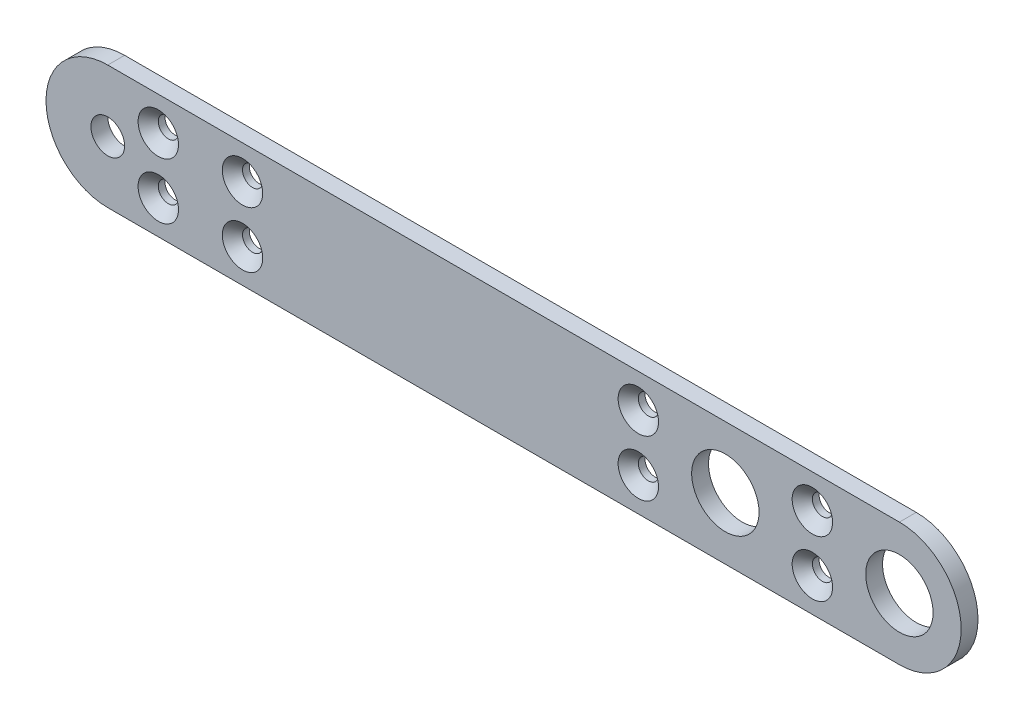
ISO-10303-21;
HEADER;
FILE_DESCRIPTION(('STEP AP214'),'2;1');
FILE_NAME('part.step','',(''),(''),'','','');
FILE_SCHEMA(('AUTOMOTIVE_DESIGN { 1 0 10303 214 1 1 1 1 }'));
ENDSEC;
DATA;
#1=APPLICATION_CONTEXT('core data for automotive mechanical design processes');
#2=APPLICATION_PROTOCOL_DEFINITION('international standard','automotive_design',2000,#1);
#3=PRODUCT_CONTEXT('',#1,'mechanical');
#4=PRODUCT('Part','Part','',(#3));
#5=PRODUCT_RELATED_PRODUCT_CATEGORY('part','',(#4));
#6=PRODUCT_DEFINITION_FORMATION('','',#4);
#7=PRODUCT_DEFINITION_CONTEXT('part definition',#1,'design');
#8=PRODUCT_DEFINITION('design','',#6,#7);
#9=PRODUCT_DEFINITION_SHAPE('','',#8);
#10=(LENGTH_UNIT() NAMED_UNIT(*) SI_UNIT(.MILLI.,.METRE.));
#11=(NAMED_UNIT(*) PLANE_ANGLE_UNIT() SI_UNIT($,.RADIAN.));
#12=(NAMED_UNIT(*) SI_UNIT($,.STERADIAN.) SOLID_ANGLE_UNIT());
#13=UNCERTAINTY_MEASURE_WITH_UNIT(LENGTH_MEASURE(1.E-05),#10,'distance_accuracy_value','');
#14=(GEOMETRIC_REPRESENTATION_CONTEXT(3) GLOBAL_UNCERTAINTY_ASSIGNED_CONTEXT((#13)) GLOBAL_UNIT_ASSIGNED_CONTEXT((#10,
#11,#12)) REPRESENTATION_CONTEXT('',''));
#15=CARTESIAN_POINT('',(0.,0.,0.));
#16=DIRECTION('',(0.,0.,1.));
#17=DIRECTION('',(1.,0.,0.));
#18=AXIS2_PLACEMENT_3D('',#15,#16,#17);
#19=CARTESIAN_POINT('',(15.5,0.,1.5));
#20=DIRECTION('',(0.,0.,1.));
#21=DIRECTION('',(1.,0.,0.));
#22=AXIS2_PLACEMENT_3D('',#19,#20,#21);
#23=PLANE('',#22);
#24=CARTESIAN_POINT('',(7.75,-2.49999999999999,1.5));
#25=DIRECTION('',(0.,0.,1.));
#26=DIRECTION('',(1.,0.,0.));
#27=AXIS2_PLACEMENT_3D('',#24,#25,#26);
#28=CIRCLE('',#27,1.8);
#29=CARTESIAN_POINT('',(9.55,-2.49999999999999,1.5));
#30=VERTEX_POINT('',#29);
#31=EDGE_CURVE('E197',#30,#30,#28,.T.);
#32=ORIENTED_EDGE('',*,*,#31,.F.);
#33=EDGE_LOOP('',(#32));
#34=FACE_BOUND('',#33,.T.);
#35=CARTESIAN_POINT('',(-7.75,-2.49999999999999,1.5));
#36=DIRECTION('',(0.,0.,1.));
#37=DIRECTION('',(1.,0.,0.));
#38=AXIS2_PLACEMENT_3D('',#35,#36,#37);
#39=CIRCLE('',#38,1.8);
#40=CARTESIAN_POINT('',(-5.95,-2.49999999999999,1.5));
#41=VERTEX_POINT('',#40);
#42=EDGE_CURVE('E188',#41,#41,#39,.T.);
#43=ORIENTED_EDGE('',*,*,#42,.F.);
#44=EDGE_LOOP('',(#43));
#45=FACE_BOUND('',#44,.T.);
#46=CARTESIAN_POINT('',(-50.5,-2.49999999999999,1.5));
#47=DIRECTION('',(0.,0.,1.));
#48=DIRECTION('',(1.,0.,0.));
#49=AXIS2_PLACEMENT_3D('',#46,#47,#48);
#50=CIRCLE('',#49,1.8);
#51=CARTESIAN_POINT('',(-48.7,-2.49999999999999,1.5));
#52=VERTEX_POINT('',#51);
#53=EDGE_CURVE('E179',#52,#52,#50,.T.);
#54=ORIENTED_EDGE('',*,*,#53,.F.);
#55=EDGE_LOOP('',(#54));
#56=FACE_BOUND('',#55,.T.);
#57=CARTESIAN_POINT('',(-43.,-2.49999999999999,1.5));
#58=DIRECTION('',(0.,0.,1.));
#59=DIRECTION('',(1.,0.,0.));
#60=AXIS2_PLACEMENT_3D('',#57,#58,#59);
#61=CIRCLE('',#60,1.8);
#62=CARTESIAN_POINT('',(-41.2,-2.49999999999999,1.5));
#63=VERTEX_POINT('',#62);
#64=EDGE_CURVE('E170',#63,#63,#61,.T.);
#65=ORIENTED_EDGE('',*,*,#64,.F.);
#66=EDGE_LOOP('',(#65));
#67=FACE_BOUND('',#66,.T.);
#68=CARTESIAN_POINT('',(7.75,2.49999999999999,1.5));
#69=DIRECTION('',(0.,0.,1.));
#70=DIRECTION('',(1.,0.,0.));
#71=AXIS2_PLACEMENT_3D('',#68,#69,#70);
#72=CIRCLE('',#71,1.8);
#73=CARTESIAN_POINT('',(9.55,2.49999999999999,1.5));
#74=VERTEX_POINT('',#73);
#75=EDGE_CURVE('E161',#74,#74,#72,.T.);
#76=ORIENTED_EDGE('',*,*,#75,.F.);
#77=EDGE_LOOP('',(#76));
#78=FACE_BOUND('',#77,.T.);
#79=CARTESIAN_POINT('',(-7.75,2.49999999999999,1.5));
#80=DIRECTION('',(0.,0.,1.));
#81=DIRECTION('',(1.,0.,0.));
#82=AXIS2_PLACEMENT_3D('',#79,#80,#81);
#83=CIRCLE('',#82,1.8);
#84=CARTESIAN_POINT('',(-5.95,2.49999999999999,1.5));
#85=VERTEX_POINT('',#84);
#86=EDGE_CURVE('E152',#85,#85,#83,.T.);
#87=ORIENTED_EDGE('',*,*,#86,.F.);
#88=EDGE_LOOP('',(#87));
#89=FACE_BOUND('',#88,.T.);
#90=CARTESIAN_POINT('',(-50.5,2.49999999999999,1.5));
#91=DIRECTION('',(0.,0.,1.));
#92=DIRECTION('',(1.,0.,0.));
#93=AXIS2_PLACEMENT_3D('',#90,#91,#92);
#94=CIRCLE('',#93,1.8);
#95=CARTESIAN_POINT('',(-48.7,2.49999999999999,1.5));
#96=VERTEX_POINT('',#95);
#97=EDGE_CURVE('E143',#96,#96,#94,.T.);
#98=ORIENTED_EDGE('',*,*,#97,.F.);
#99=EDGE_LOOP('',(#98));
#100=FACE_BOUND('',#99,.T.);
#101=CARTESIAN_POINT('',(-43.,2.49999999999999,1.5));
#102=DIRECTION('',(0.,0.,1.));
#103=DIRECTION('',(1.,0.,0.));
#104=AXIS2_PLACEMENT_3D('',#101,#102,#103);
#105=CIRCLE('',#104,1.8);
#106=CARTESIAN_POINT('',(-41.2,2.49999999999999,1.5));
#107=VERTEX_POINT('',#106);
#108=EDGE_CURVE('E134',#107,#107,#105,.T.);
#109=ORIENTED_EDGE('',*,*,#108,.F.);
#110=EDGE_LOOP('',(#109));
#111=FACE_BOUND('',#110,.T.);
#112=CARTESIAN_POINT('',(0.,0.,1.5));
#113=DIRECTION('',(0.,0.,1.));
#114=DIRECTION('',(1.,0.,0.));
#115=AXIS2_PLACEMENT_3D('',#112,#113,#114);
#116=CIRCLE('',#115,3.);
#117=CARTESIAN_POINT('',(3.,0.,1.5));
#118=VERTEX_POINT('',#117);
#119=EDGE_CURVE('E114',#118,#118,#116,.T.);
#120=ORIENTED_EDGE('',*,*,#119,.F.);
#121=EDGE_LOOP('',(#120));
#122=FACE_BOUND('',#121,.T.);
#123=CARTESIAN_POINT('',(15.5,0.,1.5));
#124=DIRECTION('',(0.,0.,1.));
#125=DIRECTION('',(1.,0.,0.));
#126=AXIS2_PLACEMENT_3D('',#123,#124,#125);
#127=CIRCLE('',#126,5.5);
#128=CARTESIAN_POINT('',(15.5,-5.5,1.5));
#129=VERTEX_POINT('',#128);
#130=CARTESIAN_POINT('',(15.5,5.5,1.5));
#131=VERTEX_POINT('',#130);
#132=EDGE_CURVE('E84',#129,#131,#127,.T.);
#133=ORIENTED_EDGE('',*,*,#132,.T.);
#134=DIRECTION('',(-1.,0.,0.));
#135=VECTOR('',#134,1.);
#136=CARTESIAN_POINT('',(15.5,5.5,1.5));
#137=LINE('',#136,#135);
#138=CARTESIAN_POINT('',(-55.,5.49999999999999,1.5));
#139=VERTEX_POINT('',#138);
#140=EDGE_CURVE('E79',#131,#139,#137,.T.);
#141=ORIENTED_EDGE('',*,*,#140,.T.);
#142=CARTESIAN_POINT('',(-55.,0.,1.5));
#143=DIRECTION('',(0.,0.,1.));
#144=DIRECTION('',(1.,0.,0.));
#145=AXIS2_PLACEMENT_3D('',#142,#143,#144);
#146=CIRCLE('',#145,5.49999999999999);
#147=CARTESIAN_POINT('',(-55.,-5.49999999999999,1.5));
#148=VERTEX_POINT('',#147);
#149=EDGE_CURVE('E82',#139,#148,#146,.T.);
#150=ORIENTED_EDGE('',*,*,#149,.T.);
#151=DIRECTION('',(1.,0.,0.));
#152=VECTOR('',#151,1.);
#153=CARTESIAN_POINT('',(-55.,-5.49999999999999,1.5));
#154=LINE('',#153,#152);
#155=EDGE_CURVE('E49',#148,#129,#154,.T.);
#156=ORIENTED_EDGE('',*,*,#155,.T.);
#157=EDGE_LOOP('',(#133,#141,#150,#156));
#158=FACE_BOUND('',#157,.T.);
#159=CARTESIAN_POINT('',(-55.,0.,1.5));
#160=DIRECTION('',(0.,0.,1.));
#161=DIRECTION('',(1.,0.,0.));
#162=AXIS2_PLACEMENT_3D('',#159,#160,#161);
#163=CIRCLE('',#162,1.5);
#164=CARTESIAN_POINT('',(-53.5,0.,1.5));
#165=VERTEX_POINT('',#164);
#166=EDGE_CURVE('E99',#165,#165,#163,.T.);
#167=ORIENTED_EDGE('',*,*,#166,.F.);
#168=EDGE_LOOP('',(#167));
#169=FACE_BOUND('',#168,.T.);
#170=CARTESIAN_POINT('',(15.5,0.,1.5));
#171=DIRECTION('',(0.,0.,1.));
#172=DIRECTION('',(1.,0.,0.));
#173=AXIS2_PLACEMENT_3D('',#170,#171,#172);
#174=CIRCLE('',#173,3.);
#175=CARTESIAN_POINT('',(18.5,0.,1.5));
#176=VERTEX_POINT('',#175);
#177=EDGE_CURVE('E120',#176,#176,#174,.T.);
#178=ORIENTED_EDGE('',*,*,#177,.F.);
#179=EDGE_LOOP('',(#178));
#180=FACE_BOUND('',#179,.T.);
#181=ADVANCED_FACE('F32',(#34,#45,#56,#67,#78,#89,#100,#111,#122,#158,#169,#180),#23,.T.);
#182=CARTESIAN_POINT('',(15.5,0.,0.));
#183=DIRECTION('',(0.,0.,1.));
#184=DIRECTION('',(1.,0.,0.));
#185=AXIS2_PLACEMENT_3D('',#182,#183,#184);
#186=PLANE('',#185);
#187=CARTESIAN_POINT('',(7.75,-2.49999999999999,0.));
#188=DIRECTION('',(0.,0.,1.));
#189=DIRECTION('',(1.,0.,0.));
#190=AXIS2_PLACEMENT_3D('',#187,#188,#189);
#191=CIRCLE('',#190,0.9);
#192=CARTESIAN_POINT('',(8.65,-2.49999999999999,0.));
#193=VERTEX_POINT('',#192);
#194=EDGE_CURVE('E191',#193,#193,#191,.T.);
#195=ORIENTED_EDGE('',*,*,#194,.T.);
#196=EDGE_LOOP('',(#195));
#197=FACE_BOUND('',#196,.T.);
#198=CARTESIAN_POINT('',(-7.75,-2.49999999999999,0.));
#199=DIRECTION('',(0.,0.,1.));
#200=DIRECTION('',(1.,0.,0.));
#201=AXIS2_PLACEMENT_3D('',#198,#199,#200);
#202=CIRCLE('',#201,0.9);
#203=CARTESIAN_POINT('',(-6.85,-2.49999999999999,0.));
#204=VERTEX_POINT('',#203);
#205=EDGE_CURVE('E182',#204,#204,#202,.T.);
#206=ORIENTED_EDGE('',*,*,#205,.T.);
#207=EDGE_LOOP('',(#206));
#208=FACE_BOUND('',#207,.T.);
#209=CARTESIAN_POINT('',(-50.5,-2.49999999999999,0.));
#210=DIRECTION('',(0.,0.,1.));
#211=DIRECTION('',(1.,0.,0.));
#212=AXIS2_PLACEMENT_3D('',#209,#210,#211);
#213=CIRCLE('',#212,0.899999999999998);
#214=CARTESIAN_POINT('',(-49.6,-2.49999999999999,0.));
#215=VERTEX_POINT('',#214);
#216=EDGE_CURVE('E173',#215,#215,#213,.T.);
#217=ORIENTED_EDGE('',*,*,#216,.T.);
#218=EDGE_LOOP('',(#217));
#219=FACE_BOUND('',#218,.T.);
#220=CARTESIAN_POINT('',(-43.,-2.49999999999999,0.));
#221=DIRECTION('',(0.,0.,1.));
#222=DIRECTION('',(1.,0.,0.));
#223=AXIS2_PLACEMENT_3D('',#220,#221,#222);
#224=CIRCLE('',#223,0.899999999999998);
#225=CARTESIAN_POINT('',(-42.1,-2.49999999999999,0.));
#226=VERTEX_POINT('',#225);
#227=EDGE_CURVE('E164',#226,#226,#224,.T.);
#228=ORIENTED_EDGE('',*,*,#227,.T.);
#229=EDGE_LOOP('',(#228));
#230=FACE_BOUND('',#229,.T.);
#231=CARTESIAN_POINT('',(7.75,2.49999999999999,0.));
#232=DIRECTION('',(0.,0.,1.));
#233=DIRECTION('',(1.,0.,0.));
#234=AXIS2_PLACEMENT_3D('',#231,#232,#233);
#235=CIRCLE('',#234,0.9);
#236=CARTESIAN_POINT('',(8.65,2.49999999999999,0.));
#237=VERTEX_POINT('',#236);
#238=EDGE_CURVE('E155',#237,#237,#235,.T.);
#239=ORIENTED_EDGE('',*,*,#238,.T.);
#240=EDGE_LOOP('',(#239));
#241=FACE_BOUND('',#240,.T.);
#242=CARTESIAN_POINT('',(-7.75,2.49999999999999,0.));
#243=DIRECTION('',(0.,0.,1.));
#244=DIRECTION('',(1.,0.,0.));
#245=AXIS2_PLACEMENT_3D('',#242,#243,#244);
#246=CIRCLE('',#245,0.9);
#247=CARTESIAN_POINT('',(-6.85,2.49999999999999,0.));
#248=VERTEX_POINT('',#247);
#249=EDGE_CURVE('E146',#248,#248,#246,.T.);
#250=ORIENTED_EDGE('',*,*,#249,.T.);
#251=EDGE_LOOP('',(#250));
#252=FACE_BOUND('',#251,.T.);
#253=CARTESIAN_POINT('',(-50.5,2.49999999999999,0.));
#254=DIRECTION('',(0.,0.,1.));
#255=DIRECTION('',(1.,0.,0.));
#256=AXIS2_PLACEMENT_3D('',#253,#254,#255);
#257=CIRCLE('',#256,0.899999999999998);
#258=CARTESIAN_POINT('',(-49.6,2.49999999999999,0.));
#259=VERTEX_POINT('',#258);
#260=EDGE_CURVE('E137',#259,#259,#257,.T.);
#261=ORIENTED_EDGE('',*,*,#260,.T.);
#262=EDGE_LOOP('',(#261));
#263=FACE_BOUND('',#262,.T.);
#264=CARTESIAN_POINT('',(-43.,2.49999999999999,0.));
#265=DIRECTION('',(0.,0.,1.));
#266=DIRECTION('',(1.,0.,0.));
#267=AXIS2_PLACEMENT_3D('',#264,#265,#266);
#268=CIRCLE('',#267,0.899999999999998);
#269=CARTESIAN_POINT('',(-42.1,2.49999999999999,0.));
#270=VERTEX_POINT('',#269);
#271=EDGE_CURVE('E126',#270,#270,#268,.T.);
#272=ORIENTED_EDGE('',*,*,#271,.T.);
#273=EDGE_LOOP('',(#272));
#274=FACE_BOUND('',#273,.T.);
#275=CARTESIAN_POINT('',(0.,0.,0.));
#276=DIRECTION('',(0.,0.,1.));
#277=DIRECTION('',(1.,0.,0.));
#278=AXIS2_PLACEMENT_3D('',#275,#276,#277);
#279=CIRCLE('',#278,3.);
#280=CARTESIAN_POINT('',(3.,0.,0.));
#281=VERTEX_POINT('',#280);
#282=EDGE_CURVE('E117',#281,#281,#279,.T.);
#283=ORIENTED_EDGE('',*,*,#282,.T.);
#284=EDGE_LOOP('',(#283));
#285=FACE_BOUND('',#284,.T.);
#286=CARTESIAN_POINT('',(15.5,0.,0.));
#287=DIRECTION('',(0.,0.,1.));
#288=DIRECTION('',(1.,0.,0.));
#289=AXIS2_PLACEMENT_3D('',#286,#287,#288);
#290=CIRCLE('',#289,5.5);
#291=CARTESIAN_POINT('',(15.5,-5.5,0.));
#292=VERTEX_POINT('',#291);
#293=CARTESIAN_POINT('',(15.5,5.5,0.));
#294=VERTEX_POINT('',#293);
#295=EDGE_CURVE('E96',#292,#294,#290,.T.);
#296=ORIENTED_EDGE('',*,*,#295,.F.);
#297=DIRECTION('',(1.,0.,0.));
#298=VECTOR('',#297,1.);
#299=CARTESIAN_POINT('',(-55.,-5.49999999999999,0.));
#300=LINE('',#299,#298);
#301=CARTESIAN_POINT('',(-55.,-5.49999999999999,0.));
#302=VERTEX_POINT('',#301);
#303=EDGE_CURVE('E72',#302,#292,#300,.T.);
#304=ORIENTED_EDGE('',*,*,#303,.F.);
#305=CARTESIAN_POINT('',(-55.,0.,0.));
#306=DIRECTION('',(0.,0.,1.));
#307=DIRECTION('',(1.,0.,0.));
#308=AXIS2_PLACEMENT_3D('',#305,#306,#307);
#309=CIRCLE('',#308,5.49999999999999);
#310=CARTESIAN_POINT('',(-55.,5.49999999999999,0.));
#311=VERTEX_POINT('',#310);
#312=EDGE_CURVE('E66',#311,#302,#309,.T.);
#313=ORIENTED_EDGE('',*,*,#312,.F.);
#314=DIRECTION('',(-1.,0.,0.));
#315=VECTOR('',#314,1.);
#316=CARTESIAN_POINT('',(15.5,5.5,0.));
#317=LINE('',#316,#315);
#318=EDGE_CURVE('E88',#294,#311,#317,.T.);
#319=ORIENTED_EDGE('',*,*,#318,.F.);
#320=EDGE_LOOP('',(#296,#304,#313,#319));
#321=FACE_BOUND('',#320,.T.);
#322=CARTESIAN_POINT('',(-55.,0.,0.));
#323=DIRECTION('',(0.,0.,1.));
#324=DIRECTION('',(1.,0.,0.));
#325=AXIS2_PLACEMENT_3D('',#322,#323,#324);
#326=CIRCLE('',#325,1.5);
#327=CARTESIAN_POINT('',(-53.5,0.,0.));
#328=VERTEX_POINT('',#327);
#329=EDGE_CURVE('E111',#328,#328,#326,.T.);
#330=ORIENTED_EDGE('',*,*,#329,.T.);
#331=EDGE_LOOP('',(#330));
#332=FACE_BOUND('',#331,.T.);
#333=CARTESIAN_POINT('',(15.5,0.,0.));
#334=DIRECTION('',(0.,0.,1.));
#335=DIRECTION('',(1.,0.,0.));
#336=AXIS2_PLACEMENT_3D('',#333,#334,#335);
#337=CIRCLE('',#336,3.);
#338=CARTESIAN_POINT('',(18.5,0.,0.));
#339=VERTEX_POINT('',#338);
#340=EDGE_CURVE('E123',#339,#339,#337,.T.);
#341=ORIENTED_EDGE('',*,*,#340,.T.);
#342=EDGE_LOOP('',(#341));
#343=FACE_BOUND('',#342,.T.);
#344=ADVANCED_FACE('F107',(#197,#208,#219,#230,#241,#252,#263,#274,#285,#321,#332,#343),#186,.F.);
#345=CARTESIAN_POINT('',(15.5,0.,1.5));
#346=DIRECTION('',(0.,0.,-1.));
#347=DIRECTION('',(-1.,0.,0.));
#348=AXIS2_PLACEMENT_3D('',#345,#346,#347);
#349=CYLINDRICAL_SURFACE('',#348,5.5);
#350=ORIENTED_EDGE('',*,*,#295,.T.);
#351=DIRECTION('',(0.,0.,-1.));
#352=VECTOR('',#351,1.);
#353=CARTESIAN_POINT('',(15.5,5.5,1.5));
#354=LINE('',#353,#352);
#355=EDGE_CURVE('E11',#131,#294,#354,.T.);
#356=ORIENTED_EDGE('',*,*,#355,.F.);
#357=ORIENTED_EDGE('',*,*,#132,.F.);
#358=DIRECTION('',(0.,0.,-1.));
#359=VECTOR('',#358,1.);
#360=CARTESIAN_POINT('',(15.5,-5.5,1.5));
#361=LINE('',#360,#359);
#362=EDGE_CURVE('E92',#129,#292,#361,.T.);
#363=ORIENTED_EDGE('',*,*,#362,.T.);
#364=EDGE_LOOP('',(#350,#356,#357,#363));
#365=FACE_BOUND('',#364,.T.);
#366=ADVANCED_FACE('F34',(#365),#349,.T.);
#367=CARTESIAN_POINT('',(15.5,5.5,1.5));
#368=DIRECTION('',(0.,-1.,0.));
#369=DIRECTION('',(1.,0.,0.));
#370=AXIS2_PLACEMENT_3D('',#367,#368,#369);
#371=PLANE('',#370);
#372=ORIENTED_EDGE('',*,*,#318,.T.);
#373=DIRECTION('',(0.,0.,-1.));
#374=VECTOR('',#373,1.);
#375=CARTESIAN_POINT('',(-55.,5.49999999999999,1.5));
#376=LINE('',#375,#374);
#377=EDGE_CURVE('E41',#139,#311,#376,.T.);
#378=ORIENTED_EDGE('',*,*,#377,.F.);
#379=ORIENTED_EDGE('',*,*,#140,.F.);
#380=ORIENTED_EDGE('',*,*,#355,.T.);
#381=EDGE_LOOP('',(#372,#378,#379,#380));
#382=FACE_BOUND('',#381,.T.);
#383=ADVANCED_FACE('F87',(#382),#371,.F.);
#384=CARTESIAN_POINT('',(-55.,0.,1.5));
#385=DIRECTION('',(0.,0.,-1.));
#386=DIRECTION('',(-1.,0.,0.));
#387=AXIS2_PLACEMENT_3D('',#384,#385,#386);
#388=CYLINDRICAL_SURFACE('',#387,5.49999999999999);
#389=ORIENTED_EDGE('',*,*,#312,.T.);
#390=DIRECTION('',(0.,0.,-1.));
#391=VECTOR('',#390,1.);
#392=CARTESIAN_POINT('',(-55.,-5.49999999999999,1.5));
#393=LINE('',#392,#391);
#394=EDGE_CURVE('E89',#148,#302,#393,.T.);
#395=ORIENTED_EDGE('',*,*,#394,.F.);
#396=ORIENTED_EDGE('',*,*,#149,.F.);
#397=ORIENTED_EDGE('',*,*,#377,.T.);
#398=EDGE_LOOP('',(#389,#395,#396,#397));
#399=FACE_BOUND('',#398,.T.);
#400=ADVANCED_FACE('F90',(#399),#388,.T.);
#401=CARTESIAN_POINT('',(-55.,-5.49999999999999,1.5));
#402=DIRECTION('',(0.,1.,0.));
#403=DIRECTION('',(-1.,0.,0.));
#404=AXIS2_PLACEMENT_3D('',#401,#402,#403);
#405=PLANE('',#404);
#406=ORIENTED_EDGE('',*,*,#303,.T.);
#407=ORIENTED_EDGE('',*,*,#362,.F.);
#408=ORIENTED_EDGE('',*,*,#155,.F.);
#409=ORIENTED_EDGE('',*,*,#394,.T.);
#410=EDGE_LOOP('',(#406,#407,#408,#409));
#411=FACE_BOUND('',#410,.T.);
#412=ADVANCED_FACE('F104',(#411),#405,.F.);
#413=CARTESIAN_POINT('',(-55.,0.,1.5));
#414=DIRECTION('',(0.,0.,-1.));
#415=DIRECTION('',(-1.,0.,0.));
#416=AXIS2_PLACEMENT_3D('',#413,#414,#415);
#417=CYLINDRICAL_SURFACE('',#416,1.5);
#418=ORIENTED_EDGE('',*,*,#166,.T.);
#419=EDGE_LOOP('',(#418));
#420=FACE_BOUND('',#419,.T.);
#421=ORIENTED_EDGE('',*,*,#329,.F.);
#422=EDGE_LOOP('',(#421));
#423=FACE_BOUND('',#422,.T.);
#424=ADVANCED_FACE('F226',(#420,#423),#417,.F.);
#425=CARTESIAN_POINT('',(0.,0.,1.5));
#426=DIRECTION('',(0.,0.,-1.));
#427=DIRECTION('',(-1.,0.,0.));
#428=AXIS2_PLACEMENT_3D('',#425,#426,#427);
#429=CYLINDRICAL_SURFACE('',#428,3.);
#430=ORIENTED_EDGE('',*,*,#119,.T.);
#431=EDGE_LOOP('',(#430));
#432=FACE_BOUND('',#431,.T.);
#433=ORIENTED_EDGE('',*,*,#282,.F.);
#434=EDGE_LOOP('',(#433));
#435=FACE_BOUND('',#434,.T.);
#436=ADVANCED_FACE('F222',(#432,#435),#429,.F.);
#437=CARTESIAN_POINT('',(15.5,0.,1.5));
#438=DIRECTION('',(0.,0.,-1.));
#439=DIRECTION('',(-1.,0.,0.));
#440=AXIS2_PLACEMENT_3D('',#437,#438,#439);
#441=CYLINDRICAL_SURFACE('',#440,3.);
#442=ORIENTED_EDGE('',*,*,#177,.T.);
#443=EDGE_LOOP('',(#442));
#444=FACE_BOUND('',#443,.T.);
#445=ORIENTED_EDGE('',*,*,#340,.F.);
#446=EDGE_LOOP('',(#445));
#447=FACE_BOUND('',#446,.T.);
#448=ADVANCED_FACE('F225',(#444,#447),#441,.F.);
#449=CARTESIAN_POINT('',(-43.,2.49999999999999,1.5));
#450=DIRECTION('',(0.,0.,1.));
#451=DIRECTION('',(1.,0.,0.));
#452=AXIS2_PLACEMENT_3D('',#449,#450,#451);
#453=CYLINDRICAL_SURFACE('',#452,0.899999999999998);
#454=ORIENTED_EDGE('',*,*,#271,.F.);
#455=EDGE_LOOP('',(#454));
#456=FACE_BOUND('',#455,.T.);
#457=CARTESIAN_POINT('',(-43.,2.49999999999999,0.6));
#458=DIRECTION('',(0.,0.,1.));
#459=DIRECTION('',(1.,0.,0.));
#460=AXIS2_PLACEMENT_3D('',#457,#458,#459);
#461=CIRCLE('',#460,0.899999999999998);
#462=CARTESIAN_POINT('',(-42.1,2.49999999999999,0.6));
#463=VERTEX_POINT('',#462);
#464=EDGE_CURVE('E131',#463,#463,#461,.T.);
#465=ORIENTED_EDGE('',*,*,#464,.T.);
#466=EDGE_LOOP('',(#465));
#467=FACE_BOUND('',#466,.T.);
#468=ADVANCED_FACE('F271',(#456,#467),#453,.F.);
#469=CARTESIAN_POINT('',(-43.,2.49999999999999,1.5));
#470=DIRECTION('',(0.,0.,1.));
#471=DIRECTION('',(1.,0.,0.));
#472=AXIS2_PLACEMENT_3D('',#469,#470,#471);
#473=CONICAL_SURFACE('',#472,1.8,0.785398163397451);
#474=ORIENTED_EDGE('',*,*,#464,.F.);
#475=EDGE_LOOP('',(#474));
#476=FACE_BOUND('',#475,.T.);
#477=ORIENTED_EDGE('',*,*,#108,.T.);
#478=EDGE_LOOP('',(#477));
#479=FACE_BOUND('',#478,.T.);
#480=ADVANCED_FACE('F279',(#476,#479),#473,.F.);
#481=CARTESIAN_POINT('',(-50.5,2.49999999999999,1.5));
#482=DIRECTION('',(0.,0.,1.));
#483=DIRECTION('',(1.,0.,0.));
#484=AXIS2_PLACEMENT_3D('',#481,#482,#483);
#485=CYLINDRICAL_SURFACE('',#484,0.899999999999998);
#486=ORIENTED_EDGE('',*,*,#260,.F.);
#487=EDGE_LOOP('',(#486));
#488=FACE_BOUND('',#487,.T.);
#489=CARTESIAN_POINT('',(-50.5,2.49999999999999,0.6));
#490=DIRECTION('',(0.,0.,1.));
#491=DIRECTION('',(1.,0.,0.));
#492=AXIS2_PLACEMENT_3D('',#489,#490,#491);
#493=CIRCLE('',#492,0.899999999999998);
#494=CARTESIAN_POINT('',(-49.6,2.49999999999999,0.6));
#495=VERTEX_POINT('',#494);
#496=EDGE_CURVE('E140',#495,#495,#493,.T.);
#497=ORIENTED_EDGE('',*,*,#496,.T.);
#498=EDGE_LOOP('',(#497));
#499=FACE_BOUND('',#498,.T.);
#500=ADVANCED_FACE('F287',(#488,#499),#485,.F.);
#501=CARTESIAN_POINT('',(-50.5,2.49999999999999,1.5));
#502=DIRECTION('',(0.,0.,1.));
#503=DIRECTION('',(1.,0.,0.));
#504=AXIS2_PLACEMENT_3D('',#501,#502,#503);
#505=CONICAL_SURFACE('',#504,1.8,0.785398163397451);
#506=ORIENTED_EDGE('',*,*,#496,.F.);
#507=EDGE_LOOP('',(#506));
#508=FACE_BOUND('',#507,.T.);
#509=ORIENTED_EDGE('',*,*,#97,.T.);
#510=EDGE_LOOP('',(#509));
#511=FACE_BOUND('',#510,.T.);
#512=ADVANCED_FACE('F295',(#508,#511),#505,.F.);
#513=CARTESIAN_POINT('',(-7.75,2.49999999999999,1.5));
#514=DIRECTION('',(0.,0.,1.));
#515=DIRECTION('',(1.,0.,0.));
#516=AXIS2_PLACEMENT_3D('',#513,#514,#515);
#517=CYLINDRICAL_SURFACE('',#516,0.9);
#518=ORIENTED_EDGE('',*,*,#249,.F.);
#519=EDGE_LOOP('',(#518));
#520=FACE_BOUND('',#519,.T.);
#521=CARTESIAN_POINT('',(-7.75,2.49999999999999,0.6));
#522=DIRECTION('',(0.,0.,1.));
#523=DIRECTION('',(1.,0.,0.));
#524=AXIS2_PLACEMENT_3D('',#521,#522,#523);
#525=CIRCLE('',#524,0.9);
#526=CARTESIAN_POINT('',(-6.85,2.49999999999999,0.6));
#527=VERTEX_POINT('',#526);
#528=EDGE_CURVE('E149',#527,#527,#525,.T.);
#529=ORIENTED_EDGE('',*,*,#528,.T.);
#530=EDGE_LOOP('',(#529));
#531=FACE_BOUND('',#530,.T.);
#532=ADVANCED_FACE('F303',(#520,#531),#517,.F.);
#533=CARTESIAN_POINT('',(-7.75,2.49999999999999,1.5));
#534=DIRECTION('',(0.,0.,1.));
#535=DIRECTION('',(1.,0.,0.));
#536=AXIS2_PLACEMENT_3D('',#533,#534,#535);
#537=CONICAL_SURFACE('',#536,1.8,0.785398163397449);
#538=ORIENTED_EDGE('',*,*,#528,.F.);
#539=EDGE_LOOP('',(#538));
#540=FACE_BOUND('',#539,.T.);
#541=ORIENTED_EDGE('',*,*,#86,.T.);
#542=EDGE_LOOP('',(#541));
#543=FACE_BOUND('',#542,.T.);
#544=ADVANCED_FACE('F311',(#540,#543),#537,.F.);
#545=CARTESIAN_POINT('',(7.75,2.49999999999999,1.5));
#546=DIRECTION('',(0.,0.,1.));
#547=DIRECTION('',(1.,0.,0.));
#548=AXIS2_PLACEMENT_3D('',#545,#546,#547);
#549=CYLINDRICAL_SURFACE('',#548,0.9);
#550=ORIENTED_EDGE('',*,*,#238,.F.);
#551=EDGE_LOOP('',(#550));
#552=FACE_BOUND('',#551,.T.);
#553=CARTESIAN_POINT('',(7.75,2.49999999999999,0.6));
#554=DIRECTION('',(0.,0.,1.));
#555=DIRECTION('',(1.,0.,0.));
#556=AXIS2_PLACEMENT_3D('',#553,#554,#555);
#557=CIRCLE('',#556,0.9);
#558=CARTESIAN_POINT('',(8.65,2.49999999999999,0.6));
#559=VERTEX_POINT('',#558);
#560=EDGE_CURVE('E158',#559,#559,#557,.T.);
#561=ORIENTED_EDGE('',*,*,#560,.T.);
#562=EDGE_LOOP('',(#561));
#563=FACE_BOUND('',#562,.T.);
#564=ADVANCED_FACE('F319',(#552,#563),#549,.F.);
#565=CARTESIAN_POINT('',(7.75,2.49999999999999,1.5));
#566=DIRECTION('',(0.,0.,1.));
#567=DIRECTION('',(1.,0.,0.));
#568=AXIS2_PLACEMENT_3D('',#565,#566,#567);
#569=CONICAL_SURFACE('',#568,1.8,0.785398163397448);
#570=ORIENTED_EDGE('',*,*,#560,.F.);
#571=EDGE_LOOP('',(#570));
#572=FACE_BOUND('',#571,.T.);
#573=ORIENTED_EDGE('',*,*,#75,.T.);
#574=EDGE_LOOP('',(#573));
#575=FACE_BOUND('',#574,.T.);
#576=ADVANCED_FACE('F327',(#572,#575),#569,.F.);
#577=CARTESIAN_POINT('',(-43.,-2.49999999999999,1.5));
#578=DIRECTION('',(0.,0.,1.));
#579=DIRECTION('',(1.,0.,0.));
#580=AXIS2_PLACEMENT_3D('',#577,#578,#579);
#581=CYLINDRICAL_SURFACE('',#580,0.899999999999998);
#582=ORIENTED_EDGE('',*,*,#227,.F.);
#583=EDGE_LOOP('',(#582));
#584=FACE_BOUND('',#583,.T.);
#585=CARTESIAN_POINT('',(-43.,-2.49999999999999,0.6));
#586=DIRECTION('',(0.,0.,1.));
#587=DIRECTION('',(1.,0.,0.));
#588=AXIS2_PLACEMENT_3D('',#585,#586,#587);
#589=CIRCLE('',#588,0.899999999999998);
#590=CARTESIAN_POINT('',(-42.1,-2.49999999999999,0.6));
#591=VERTEX_POINT('',#590);
#592=EDGE_CURVE('E167',#591,#591,#589,.T.);
#593=ORIENTED_EDGE('',*,*,#592,.T.);
#594=EDGE_LOOP('',(#593));
#595=FACE_BOUND('',#594,.T.);
#596=ADVANCED_FACE('F335',(#584,#595),#581,.F.);
#597=CARTESIAN_POINT('',(-43.,-2.49999999999999,1.5));
#598=DIRECTION('',(0.,0.,1.));
#599=DIRECTION('',(1.,0.,0.));
#600=AXIS2_PLACEMENT_3D('',#597,#598,#599);
#601=CONICAL_SURFACE('',#600,1.8,0.785398163397451);
#602=ORIENTED_EDGE('',*,*,#592,.F.);
#603=EDGE_LOOP('',(#602));
#604=FACE_BOUND('',#603,.T.);
#605=ORIENTED_EDGE('',*,*,#64,.T.);
#606=EDGE_LOOP('',(#605));
#607=FACE_BOUND('',#606,.T.);
#608=ADVANCED_FACE('F344',(#604,#607),#601,.F.);
#609=CARTESIAN_POINT('',(-50.5,-2.49999999999999,1.5));
#610=DIRECTION('',(0.,0.,1.));
#611=DIRECTION('',(1.,0.,0.));
#612=AXIS2_PLACEMENT_3D('',#609,#610,#611);
#613=CYLINDRICAL_SURFACE('',#612,0.899999999999998);
#614=ORIENTED_EDGE('',*,*,#216,.F.);
#615=EDGE_LOOP('',(#614));
#616=FACE_BOUND('',#615,.T.);
#617=CARTESIAN_POINT('',(-50.5,-2.49999999999999,0.6));
#618=DIRECTION('',(0.,0.,1.));
#619=DIRECTION('',(1.,0.,0.));
#620=AXIS2_PLACEMENT_3D('',#617,#618,#619);
#621=CIRCLE('',#620,0.899999999999998);
#622=CARTESIAN_POINT('',(-49.6,-2.49999999999999,0.6));
#623=VERTEX_POINT('',#622);
#624=EDGE_CURVE('E176',#623,#623,#621,.T.);
#625=ORIENTED_EDGE('',*,*,#624,.T.);
#626=EDGE_LOOP('',(#625));
#627=FACE_BOUND('',#626,.T.);
#628=ADVANCED_FACE('F352',(#616,#627),#613,.F.);
#629=CARTESIAN_POINT('',(-50.5,-2.49999999999999,1.5));
#630=DIRECTION('',(0.,0.,1.));
#631=DIRECTION('',(1.,0.,0.));
#632=AXIS2_PLACEMENT_3D('',#629,#630,#631);
#633=CONICAL_SURFACE('',#632,1.8,0.785398163397451);
#634=ORIENTED_EDGE('',*,*,#624,.F.);
#635=EDGE_LOOP('',(#634));
#636=FACE_BOUND('',#635,.T.);
#637=ORIENTED_EDGE('',*,*,#53,.T.);
#638=EDGE_LOOP('',(#637));
#639=FACE_BOUND('',#638,.T.);
#640=ADVANCED_FACE('F360',(#636,#639),#633,.F.);
#641=CARTESIAN_POINT('',(-7.75,-2.49999999999999,1.5));
#642=DIRECTION('',(0.,0.,1.));
#643=DIRECTION('',(1.,0.,0.));
#644=AXIS2_PLACEMENT_3D('',#641,#642,#643);
#645=CYLINDRICAL_SURFACE('',#644,0.9);
#646=ORIENTED_EDGE('',*,*,#205,.F.);
#647=EDGE_LOOP('',(#646));
#648=FACE_BOUND('',#647,.T.);
#649=CARTESIAN_POINT('',(-7.75,-2.49999999999999,0.6));
#650=DIRECTION('',(0.,0.,1.));
#651=DIRECTION('',(1.,0.,0.));
#652=AXIS2_PLACEMENT_3D('',#649,#650,#651);
#653=CIRCLE('',#652,0.9);
#654=CARTESIAN_POINT('',(-6.85,-2.49999999999999,0.6));
#655=VERTEX_POINT('',#654);
#656=EDGE_CURVE('E185',#655,#655,#653,.T.);
#657=ORIENTED_EDGE('',*,*,#656,.T.);
#658=EDGE_LOOP('',(#657));
#659=FACE_BOUND('',#658,.T.);
#660=ADVANCED_FACE('F368',(#648,#659),#645,.F.);
#661=CARTESIAN_POINT('',(-7.75,-2.49999999999999,1.5));
#662=DIRECTION('',(0.,0.,1.));
#663=DIRECTION('',(1.,0.,0.));
#664=AXIS2_PLACEMENT_3D('',#661,#662,#663);
#665=CONICAL_SURFACE('',#664,1.8,0.785398163397449);
#666=ORIENTED_EDGE('',*,*,#656,.F.);
#667=EDGE_LOOP('',(#666));
#668=FACE_BOUND('',#667,.T.);
#669=ORIENTED_EDGE('',*,*,#42,.T.);
#670=EDGE_LOOP('',(#669));
#671=FACE_BOUND('',#670,.T.);
#672=ADVANCED_FACE('F376',(#668,#671),#665,.F.);
#673=CARTESIAN_POINT('',(7.75,-2.49999999999999,1.5));
#674=DIRECTION('',(0.,0.,1.));
#675=DIRECTION('',(1.,0.,0.));
#676=AXIS2_PLACEMENT_3D('',#673,#674,#675);
#677=CYLINDRICAL_SURFACE('',#676,0.9);
#678=ORIENTED_EDGE('',*,*,#194,.F.);
#679=EDGE_LOOP('',(#678));
#680=FACE_BOUND('',#679,.T.);
#681=CARTESIAN_POINT('',(7.75,-2.49999999999999,0.6));
#682=DIRECTION('',(0.,0.,1.));
#683=DIRECTION('',(1.,0.,0.));
#684=AXIS2_PLACEMENT_3D('',#681,#682,#683);
#685=CIRCLE('',#684,0.9);
#686=CARTESIAN_POINT('',(8.65,-2.49999999999999,0.6));
#687=VERTEX_POINT('',#686);
#688=EDGE_CURVE('E194',#687,#687,#685,.T.);
#689=ORIENTED_EDGE('',*,*,#688,.T.);
#690=EDGE_LOOP('',(#689));
#691=FACE_BOUND('',#690,.T.);
#692=ADVANCED_FACE('F384',(#680,#691),#677,.F.);
#693=CARTESIAN_POINT('',(7.75,-2.49999999999999,1.5));
#694=DIRECTION('',(0.,0.,1.));
#695=DIRECTION('',(1.,0.,0.));
#696=AXIS2_PLACEMENT_3D('',#693,#694,#695);
#697=CONICAL_SURFACE('',#696,1.8,0.785398163397448);
#698=ORIENTED_EDGE('',*,*,#688,.F.);
#699=EDGE_LOOP('',(#698));
#700=FACE_BOUND('',#699,.T.);
#701=ORIENTED_EDGE('',*,*,#31,.T.);
#702=EDGE_LOOP('',(#701));
#703=FACE_BOUND('',#702,.T.);
#704=ADVANCED_FACE('F201',(#700,#703),#697,.F.);
#705=CLOSED_SHELL('',(#181,#344,#366,#383,#400,#412,#424,#436,#448,#468,#480,#500,#512,#532,
#544,#564,#576,#596,#608,#628,#640,#660,#672,#692,#704));
#706=MANIFOLD_SOLID_BREP('B2',#705);
#707=ADVANCED_BREP_SHAPE_REPRESENTATION('',(#18,#706),#14);
#708=SHAPE_DEFINITION_REPRESENTATION(#9,#707);
ENDSEC;
END-ISO-10303-21;
